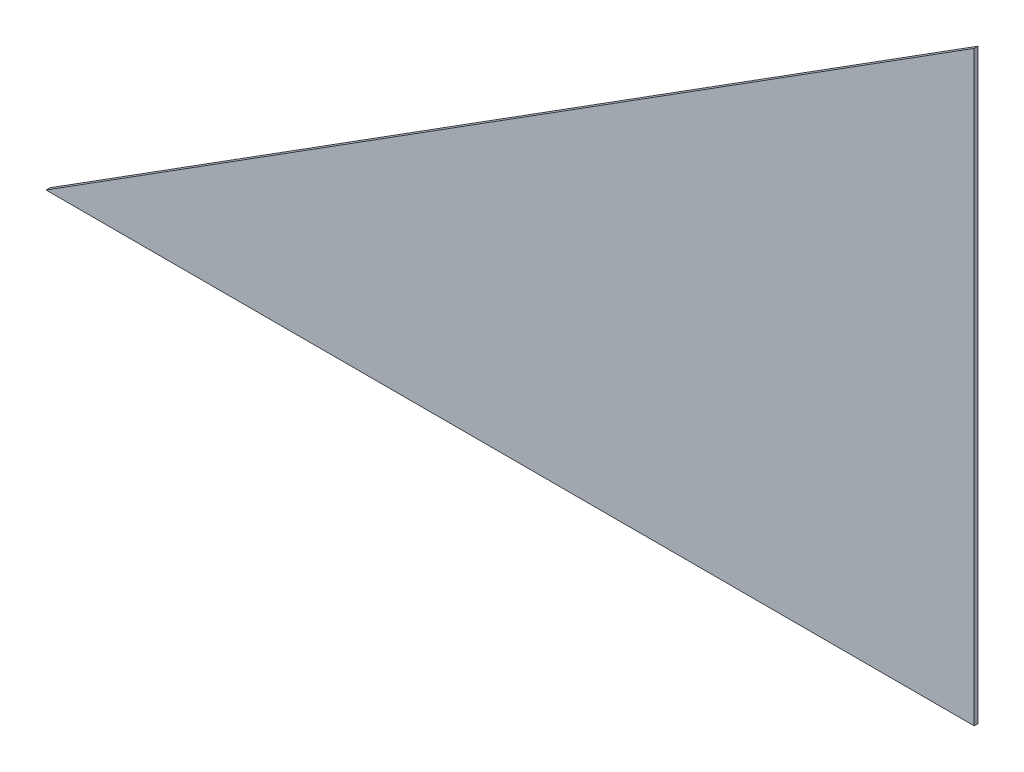
ISO-10303-21;
HEADER;
FILE_DESCRIPTION(('STEP AP214'),'2;1');
FILE_NAME('part.step','',(''),(''),'','','');
FILE_SCHEMA(('AUTOMOTIVE_DESIGN { 1 0 10303 214 1 1 1 1 }'));
ENDSEC;
DATA;
#1=APPLICATION_CONTEXT('core data for automotive mechanical design processes');
#2=APPLICATION_PROTOCOL_DEFINITION('international standard','automotive_design',2000,#1);
#3=PRODUCT_CONTEXT('',#1,'mechanical');
#4=PRODUCT('Part','Part','',(#3));
#5=PRODUCT_RELATED_PRODUCT_CATEGORY('part','',(#4));
#6=PRODUCT_DEFINITION_FORMATION('','',#4);
#7=PRODUCT_DEFINITION_CONTEXT('part definition',#1,'design');
#8=PRODUCT_DEFINITION('design','',#6,#7);
#9=PRODUCT_DEFINITION_SHAPE('','',#8);
#10=(LENGTH_UNIT() NAMED_UNIT(*) SI_UNIT(.MILLI.,.METRE.));
#11=(NAMED_UNIT(*) PLANE_ANGLE_UNIT() SI_UNIT($,.RADIAN.));
#12=(NAMED_UNIT(*) SI_UNIT($,.STERADIAN.) SOLID_ANGLE_UNIT());
#13=UNCERTAINTY_MEASURE_WITH_UNIT(LENGTH_MEASURE(1.E-05),#10,'distance_accuracy_value','');
#14=(GEOMETRIC_REPRESENTATION_CONTEXT(3) GLOBAL_UNCERTAINTY_ASSIGNED_CONTEXT((#13)) GLOBAL_UNIT_ASSIGNED_CONTEXT((#10,
#11,#12)) REPRESENTATION_CONTEXT('',''));
#15=CARTESIAN_POINT('',(0.,0.,0.));
#16=DIRECTION('',(0.,0.,1.));
#17=DIRECTION('',(1.,0.,0.));
#18=AXIS2_PLACEMENT_3D('',#15,#16,#17);
#19=CARTESIAN_POINT('',(523.432542325574,2206.85437756192,1118.7145563695));
#20=DIRECTION('',(0.534316831283238,-0.845284285792324,0.));
#21=DIRECTION('',(0.845284285792324,0.534316831283238,0.));
#22=AXIS2_PLACEMENT_3D('',#19,#20,#21);
#23=PLANE('',#22);
#24=DIRECTION('',(0.845284285792324,0.534316831283238,0.));
#25=VECTOR('',#24,1.);
#26=CARTESIAN_POINT('',(523.432542325574,2206.85437756192,1121.2545563695));
#27=LINE('',#26,#25);
#28=CARTESIAN_POINT('',(-86.1674576744258,1821.51710603682,1121.2545563695));
#29=VERTEX_POINT('',#28);
#30=CARTESIAN_POINT('',(523.432542325574,2206.85437756192,1121.2545563695));
#31=VERTEX_POINT('',#30);
#32=EDGE_CURVE('E82',#29,#31,#27,.T.);
#33=ORIENTED_EDGE('',*,*,#32,.T.);
#34=DIRECTION('',(0.,0.,1.));
#35=VECTOR('',#34,1.);
#36=CARTESIAN_POINT('',(523.432542325574,2206.85437756192,1118.7145563695));
#37=LINE('',#36,#35);
#38=CARTESIAN_POINT('',(523.432542325574,2206.85437756192,1118.7145563695));
#39=VERTEX_POINT('',#38);
#40=EDGE_CURVE('E11',#39,#31,#37,.T.);
#41=ORIENTED_EDGE('',*,*,#40,.F.);
#42=DIRECTION('',(0.845284285792324,0.534316831283238,0.));
#43=VECTOR('',#42,1.);
#44=CARTESIAN_POINT('',(523.432542325574,2206.85437756192,1118.7145563695));
#45=LINE('',#44,#43);
#46=CARTESIAN_POINT('',(-86.1674576744258,1821.51710603682,1118.7145563695));
#47=VERTEX_POINT('',#46);
#48=EDGE_CURVE('E75',#47,#39,#45,.T.);
#49=ORIENTED_EDGE('',*,*,#48,.F.);
#50=DIRECTION('',(0.,0.,1.));
#51=VECTOR('',#50,1.);
#52=CARTESIAN_POINT('',(-86.1674576744258,1821.51710603682,1118.7145563695));
#53=LINE('',#52,#51);
#54=EDGE_CURVE('E83',#47,#29,#53,.T.);
#55=ORIENTED_EDGE('',*,*,#54,.T.);
#56=EDGE_LOOP('',(#33,#41,#49,#55));
#57=FACE_BOUND('',#56,.T.);
#58=ADVANCED_FACE('F35',(#57),#23,.F.);
#59=CARTESIAN_POINT('',(523.432542325574,1821.51710603682,1118.7145563695));
#60=DIRECTION('',(-1.,0.,0.));
#61=DIRECTION('',(0.,-1.,0.));
#62=AXIS2_PLACEMENT_3D('',#59,#60,#61);
#63=PLANE('',#62);
#64=DIRECTION('',(0.,-1.,0.));
#65=VECTOR('',#64,1.);
#66=CARTESIAN_POINT('',(523.432542325574,1821.51710603682,1121.2545563695));
#67=LINE('',#66,#65);
#68=CARTESIAN_POINT('',(523.432542325574,1821.51710603682,1121.2545563695));
#69=VERTEX_POINT('',#68);
#70=EDGE_CURVE('E63',#31,#69,#67,.T.);
#71=ORIENTED_EDGE('',*,*,#70,.T.);
#72=DIRECTION('',(0.,0.,1.));
#73=VECTOR('',#72,1.);
#74=CARTESIAN_POINT('',(523.432542325574,1821.51710603682,1118.7145563695));
#75=LINE('',#74,#73);
#76=CARTESIAN_POINT('',(523.432542325574,1821.51710603682,1118.7145563695));
#77=VERTEX_POINT('',#76);
#78=EDGE_CURVE('E43',#77,#69,#75,.T.);
#79=ORIENTED_EDGE('',*,*,#78,.F.);
#80=DIRECTION('',(0.,-1.,0.));
#81=VECTOR('',#80,1.);
#82=CARTESIAN_POINT('',(523.432542325574,1821.51710603682,1118.7145563695));
#83=LINE('',#82,#81);
#84=EDGE_CURVE('E71',#39,#77,#83,.T.);
#85=ORIENTED_EDGE('',*,*,#84,.F.);
#86=ORIENTED_EDGE('',*,*,#40,.T.);
#87=EDGE_LOOP('',(#71,#79,#85,#86));
#88=FACE_BOUND('',#87,.T.);
#89=ADVANCED_FACE('F72',(#88),#63,.F.);
#90=CARTESIAN_POINT('',(-86.1674576744258,1821.51710603682,1118.7145563695));
#91=DIRECTION('',(0.,1.,0.));
#92=DIRECTION('',(-1.,0.,0.));
#93=AXIS2_PLACEMENT_3D('',#90,#91,#92);
#94=PLANE('',#93);
#95=DIRECTION('',(-1.,0.,0.));
#96=VECTOR('',#95,1.);
#97=CARTESIAN_POINT('',(-86.1674576744258,1821.51710603682,1121.2545563695));
#98=LINE('',#97,#96);
#99=EDGE_CURVE('E68',#69,#29,#98,.T.);
#100=ORIENTED_EDGE('',*,*,#99,.T.);
#101=ORIENTED_EDGE('',*,*,#54,.F.);
#102=DIRECTION('',(-1.,0.,0.));
#103=VECTOR('',#102,1.);
#104=CARTESIAN_POINT('',(-86.1674576744258,1821.51710603682,1118.7145563695));
#105=LINE('',#104,#103);
#106=EDGE_CURVE('E51',#77,#47,#105,.T.);
#107=ORIENTED_EDGE('',*,*,#106,.F.);
#108=ORIENTED_EDGE('',*,*,#78,.T.);
#109=EDGE_LOOP('',(#100,#101,#107,#108));
#110=FACE_BOUND('',#109,.T.);
#111=ADVANCED_FACE('F90',(#110),#94,.F.);
#112=CARTESIAN_POINT('',(0.,0.,1118.7145563695));
#113=DIRECTION('',(0.,0.,-1.));
#114=DIRECTION('',(-1.,0.,0.));
#115=AXIS2_PLACEMENT_3D('',#112,#113,#114);
#116=PLANE('',#115);
#117=ORIENTED_EDGE('',*,*,#48,.T.);
#118=ORIENTED_EDGE('',*,*,#84,.T.);
#119=ORIENTED_EDGE('',*,*,#106,.T.);
#120=EDGE_LOOP('',(#117,#118,#119));
#121=FACE_BOUND('',#120,.T.);
#122=ADVANCED_FACE('F78',(#121),#116,.T.);
#123=CARTESIAN_POINT('',(0.,0.,1121.2545563695));
#124=DIRECTION('',(0.,0.,-1.));
#125=DIRECTION('',(-1.,0.,0.));
#126=AXIS2_PLACEMENT_3D('',#123,#124,#125);
#127=PLANE('',#126);
#128=ORIENTED_EDGE('',*,*,#32,.F.);
#129=ORIENTED_EDGE('',*,*,#99,.F.);
#130=ORIENTED_EDGE('',*,*,#70,.F.);
#131=EDGE_LOOP('',(#128,#129,#130));
#132=FACE_BOUND('',#131,.T.);
#133=ADVANCED_FACE('F91',(#132),#127,.F.);
#134=CLOSED_SHELL('',(#58,#89,#111,#122,#133));
#135=MANIFOLD_SOLID_BREP('B2',#134);
#136=ADVANCED_BREP_SHAPE_REPRESENTATION('',(#18,#135),#14);
#137=SHAPE_DEFINITION_REPRESENTATION(#9,#136);
ENDSEC;
END-ISO-10303-21;
